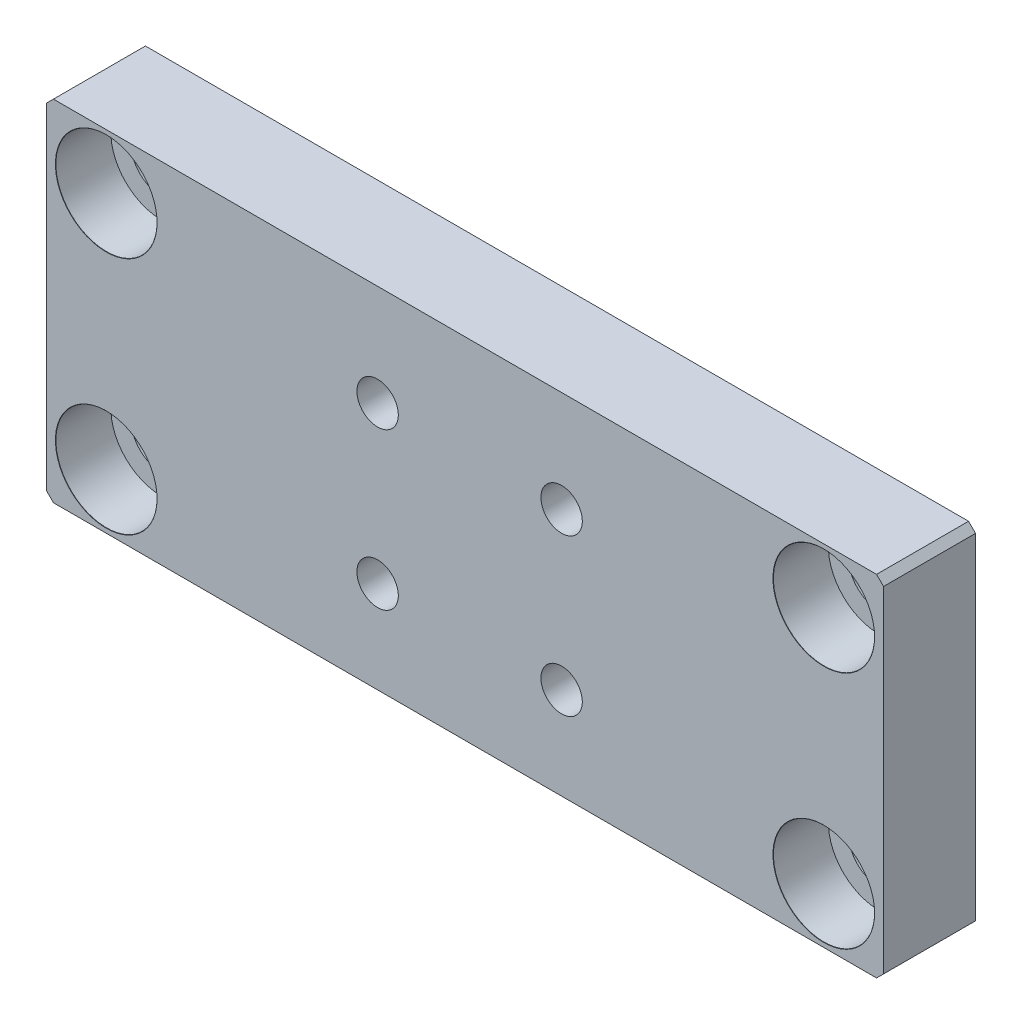
ISO-10303-21;
HEADER;
FILE_DESCRIPTION(('STEP AP214'),'2;1');
FILE_NAME('part.step','',(''),(''),'','','');
FILE_SCHEMA(('AUTOMOTIVE_DESIGN { 1 0 10303 214 1 1 1 1 }'));
ENDSEC;
DATA;
#1=APPLICATION_CONTEXT('core data for automotive mechanical design processes');
#2=APPLICATION_PROTOCOL_DEFINITION('international standard','automotive_design',2000,#1);
#3=PRODUCT_CONTEXT('',#1,'mechanical');
#4=PRODUCT('Part','Part','',(#3));
#5=PRODUCT_RELATED_PRODUCT_CATEGORY('part','',(#4));
#6=PRODUCT_DEFINITION_FORMATION('','',#4);
#7=PRODUCT_DEFINITION_CONTEXT('part definition',#1,'design');
#8=PRODUCT_DEFINITION('design','',#6,#7);
#9=PRODUCT_DEFINITION_SHAPE('','',#8);
#10=(LENGTH_UNIT() NAMED_UNIT(*) SI_UNIT(.MILLI.,.METRE.));
#11=(NAMED_UNIT(*) PLANE_ANGLE_UNIT() SI_UNIT($,.RADIAN.));
#12=(NAMED_UNIT(*) SI_UNIT($,.STERADIAN.) SOLID_ANGLE_UNIT());
#13=UNCERTAINTY_MEASURE_WITH_UNIT(LENGTH_MEASURE(1.E-05),#10,'distance_accuracy_value','');
#14=(GEOMETRIC_REPRESENTATION_CONTEXT(3) GLOBAL_UNCERTAINTY_ASSIGNED_CONTEXT((#13)) GLOBAL_UNIT_ASSIGNED_CONTEXT((#10,
#11,#12)) REPRESENTATION_CONTEXT('',''));
#15=CARTESIAN_POINT('',(0.,0.,0.));
#16=DIRECTION('',(0.,0.,1.));
#17=DIRECTION('',(1.,0.,0.));
#18=AXIS2_PLACEMENT_3D('',#15,#16,#17);
#19=CARTESIAN_POINT('',(37.0000011026499,28.99999971685,0.));
#20=DIRECTION('',(0.,0.,-1.));
#21=DIRECTION('',(-1.,0.,0.));
#22=AXIS2_PLACEMENT_3D('',#19,#20,#21);
#23=CONICAL_SURFACE('',#22,4.025,0.785398163397479);
#24=CARTESIAN_POINT('',(37.0000011026499,28.99999971685,0.0250000000000027));
#25=DIRECTION('',(0.,0.,-1.));
#26=DIRECTION('',(-1.,0.,0.));
#27=AXIS2_PLACEMENT_3D('',#24,#25,#26);
#28=CIRCLE('',#27,4.);
#29=CARTESIAN_POINT('',(33.0000011026499,28.99999971685,0.0250000000000027));
#30=VERTEX_POINT('',#29);
#31=EDGE_CURVE('E11',#30,#30,#28,.T.);
#32=ORIENTED_EDGE('',*,*,#31,.F.);
#33=EDGE_LOOP('',(#32));
#34=FACE_BOUND('',#33,.T.);
#35=CARTESIAN_POINT('',(37.0000011026499,28.99999971685,0.));
#36=DIRECTION('',(0.,0.,-1.));
#37=DIRECTION('',(-1.,0.,0.));
#38=AXIS2_PLACEMENT_3D('',#35,#36,#37);
#39=CIRCLE('',#38,4.025);
#40=CARTESIAN_POINT('',(32.9750011026498,28.99999971685,0.));
#41=VERTEX_POINT('',#40);
#42=EDGE_CURVE('E206',#41,#41,#39,.T.);
#43=ORIENTED_EDGE('',*,*,#42,.T.);
#44=EDGE_LOOP('',(#43));
#45=FACE_BOUND('',#44,.T.);
#46=ADVANCED_FACE('F33',(#34,#45),#23,.F.);
#47=CARTESIAN_POINT('',(37.0000011026499,28.99999971685,0.));
#48=DIRECTION('',(0.,0.,-1.));
#49=DIRECTION('',(-1.,0.,0.));
#50=AXIS2_PLACEMENT_3D('',#47,#48,#49);
#51=CYLINDRICAL_SURFACE('',#50,4.);
#52=CARTESIAN_POINT('',(37.0000011026499,28.99999971685,4.));
#53=DIRECTION('',(0.,0.,-1.));
#54=DIRECTION('',(-1.,0.,0.));
#55=AXIS2_PLACEMENT_3D('',#52,#53,#54);
#56=CIRCLE('',#55,4.);
#57=CARTESIAN_POINT('',(33.0000011026499,28.99999971685,4.));
#58=VERTEX_POINT('',#57);
#59=EDGE_CURVE('E41',#58,#58,#56,.T.);
#60=ORIENTED_EDGE('',*,*,#59,.F.);
#61=EDGE_LOOP('',(#60));
#62=FACE_BOUND('',#61,.T.);
#63=ORIENTED_EDGE('',*,*,#31,.T.);
#64=EDGE_LOOP('',(#63));
#65=FACE_BOUND('',#64,.T.);
#66=ADVANCED_FACE('F219',(#62,#65),#51,.F.);
#67=CARTESIAN_POINT('',(41.0000011026499,28.99999971685,4.));
#68=DIRECTION('',(0.,0.,1.));
#69=DIRECTION('',(1.,0.,0.));
#70=AXIS2_PLACEMENT_3D('',#67,#68,#69);
#71=PLANE('',#70);
#72=CARTESIAN_POINT('',(37.0000011026499,28.99999971685,4.));
#73=DIRECTION('',(0.,0.,-1.));
#74=DIRECTION('',(-1.,0.,0.));
#75=AXIS2_PLACEMENT_3D('',#72,#73,#74);
#76=CIRCLE('',#75,2.25);
#77=CARTESIAN_POINT('',(34.7500011026498,28.99999971685,4.));
#78=VERTEX_POINT('',#77);
#79=EDGE_CURVE('E212',#78,#78,#76,.T.);
#80=ORIENTED_EDGE('',*,*,#79,.F.);
#81=EDGE_LOOP('',(#80));
#82=FACE_BOUND('',#81,.T.);
#83=ORIENTED_EDGE('',*,*,#59,.T.);
#84=EDGE_LOOP('',(#83));
#85=FACE_BOUND('',#84,.T.);
#86=ADVANCED_FACE('F217',(#82,#85),#71,.F.);
#87=CARTESIAN_POINT('',(37.0000011026499,28.99999971685,0.));
#88=DIRECTION('',(0.,0.,-1.));
#89=DIRECTION('',(-1.,0.,0.));
#90=AXIS2_PLACEMENT_3D('',#87,#88,#89);
#91=CYLINDRICAL_SURFACE('',#90,2.25);
#92=CARTESIAN_POINT('',(37.0000011026499,28.99999971685,10.));
#93=DIRECTION('',(0.,0.,-1.));
#94=DIRECTION('',(-1.,0.,0.));
#95=AXIS2_PLACEMENT_3D('',#92,#93,#94);
#96=CIRCLE('',#95,2.25);
#97=CARTESIAN_POINT('',(34.7500011026499,28.99999971685,10.));
#98=VERTEX_POINT('',#97);
#99=EDGE_CURVE('E209',#98,#98,#96,.T.);
#100=ORIENTED_EDGE('',*,*,#99,.F.);
#101=EDGE_LOOP('',(#100));
#102=FACE_BOUND('',#101,.T.);
#103=ORIENTED_EDGE('',*,*,#79,.T.);
#104=EDGE_LOOP('',(#103));
#105=FACE_BOUND('',#104,.T.);
#106=ADVANCED_FACE('F318',(#102,#105),#91,.F.);
#107=CARTESIAN_POINT('',(57.0000011026499,28.99999971685,0.));
#108=DIRECTION('',(0.,0.,-1.));
#109=DIRECTION('',(-1.,0.,0.));
#110=AXIS2_PLACEMENT_3D('',#107,#108,#109);
#111=CONICAL_SURFACE('',#110,4.025,0.785398163397479);
#112=CARTESIAN_POINT('',(57.0000011026499,28.99999971685,0.0250000000000027));
#113=DIRECTION('',(0.,0.,-1.));
#114=DIRECTION('',(-1.,0.,0.));
#115=AXIS2_PLACEMENT_3D('',#112,#113,#114);
#116=CIRCLE('',#115,4.);
#117=CARTESIAN_POINT('',(53.0000011026499,28.99999971685,0.0250000000000027));
#118=VERTEX_POINT('',#117);
#119=EDGE_CURVE('E203',#118,#118,#116,.T.);
#120=ORIENTED_EDGE('',*,*,#119,.F.);
#121=EDGE_LOOP('',(#120));
#122=FACE_BOUND('',#121,.T.);
#123=CARTESIAN_POINT('',(57.0000011026499,28.99999971685,0.));
#124=DIRECTION('',(0.,0.,-1.));
#125=DIRECTION('',(-1.,0.,0.));
#126=AXIS2_PLACEMENT_3D('',#123,#124,#125);
#127=CIRCLE('',#126,4.025);
#128=CARTESIAN_POINT('',(52.9750011026499,28.99999971685,0.));
#129=VERTEX_POINT('',#128);
#130=EDGE_CURVE('E191',#129,#129,#127,.T.);
#131=ORIENTED_EDGE('',*,*,#130,.T.);
#132=EDGE_LOOP('',(#131));
#133=FACE_BOUND('',#132,.T.);
#134=ADVANCED_FACE('F314',(#122,#133),#111,.F.);
#135=CARTESIAN_POINT('',(57.0000011026499,28.99999971685,0.));
#136=DIRECTION('',(0.,0.,-1.));
#137=DIRECTION('',(-1.,0.,0.));
#138=AXIS2_PLACEMENT_3D('',#135,#136,#137);
#139=CYLINDRICAL_SURFACE('',#138,4.);
#140=CARTESIAN_POINT('',(57.0000011026499,28.99999971685,4.));
#141=DIRECTION('',(0.,0.,-1.));
#142=DIRECTION('',(-1.,0.,0.));
#143=AXIS2_PLACEMENT_3D('',#140,#141,#142);
#144=CIRCLE('',#143,4.);
#145=CARTESIAN_POINT('',(53.0000011026499,28.99999971685,4.));
#146=VERTEX_POINT('',#145);
#147=EDGE_CURVE('E200',#146,#146,#144,.T.);
#148=ORIENTED_EDGE('',*,*,#147,.F.);
#149=EDGE_LOOP('',(#148));
#150=FACE_BOUND('',#149,.T.);
#151=ORIENTED_EDGE('',*,*,#119,.T.);
#152=EDGE_LOOP('',(#151));
#153=FACE_BOUND('',#152,.T.);
#154=ADVANCED_FACE('F310',(#150,#153),#139,.F.);
#155=CARTESIAN_POINT('',(61.0000011026499,28.99999971685,4.));
#156=DIRECTION('',(0.,0.,1.));
#157=DIRECTION('',(1.,0.,0.));
#158=AXIS2_PLACEMENT_3D('',#155,#156,#157);
#159=PLANE('',#158);
#160=CARTESIAN_POINT('',(57.0000011026499,28.99999971685,4.));
#161=DIRECTION('',(0.,0.,-1.));
#162=DIRECTION('',(-1.,0.,0.));
#163=AXIS2_PLACEMENT_3D('',#160,#161,#162);
#164=CIRCLE('',#163,2.25);
#165=CARTESIAN_POINT('',(54.7500011026499,28.99999971685,4.));
#166=VERTEX_POINT('',#165);
#167=EDGE_CURVE('E197',#166,#166,#164,.T.);
#168=ORIENTED_EDGE('',*,*,#167,.F.);
#169=EDGE_LOOP('',(#168));
#170=FACE_BOUND('',#169,.T.);
#171=ORIENTED_EDGE('',*,*,#147,.T.);
#172=EDGE_LOOP('',(#171));
#173=FACE_BOUND('',#172,.T.);
#174=ADVANCED_FACE('F306',(#170,#173),#159,.F.);
#175=CARTESIAN_POINT('',(57.0000011026499,28.99999971685,0.));
#176=DIRECTION('',(0.,0.,-1.));
#177=DIRECTION('',(-1.,0.,0.));
#178=AXIS2_PLACEMENT_3D('',#175,#176,#177);
#179=CYLINDRICAL_SURFACE('',#178,2.25);
#180=CARTESIAN_POINT('',(57.0000011026499,28.99999971685,10.));
#181=DIRECTION('',(0.,0.,-1.));
#182=DIRECTION('',(-1.,0.,0.));
#183=AXIS2_PLACEMENT_3D('',#180,#181,#182);
#184=CIRCLE('',#183,2.25);
#185=CARTESIAN_POINT('',(54.7500011026499,28.99999971685,10.));
#186=VERTEX_POINT('',#185);
#187=EDGE_CURVE('E194',#186,#186,#184,.T.);
#188=ORIENTED_EDGE('',*,*,#187,.F.);
#189=EDGE_LOOP('',(#188));
#190=FACE_BOUND('',#189,.T.);
#191=ORIENTED_EDGE('',*,*,#167,.T.);
#192=EDGE_LOOP('',(#191));
#193=FACE_BOUND('',#192,.T.);
#194=ADVANCED_FACE('F302',(#190,#193),#179,.F.);
#195=CARTESIAN_POINT('',(85.5000011026498,7.99999971685001,10.));
#196=DIRECTION('',(0.,0.,1.));
#197=DIRECTION('',(1.,0.,0.));
#198=AXIS2_PLACEMENT_3D('',#195,#196,#197);
#199=CONICAL_SURFACE('',#198,5.525,0.785398163397448);
#200=CARTESIAN_POINT('',(85.5000011026498,7.99999971685001,9.975));
#201=DIRECTION('',(0.,0.,1.));
#202=DIRECTION('',(1.,0.,0.));
#203=AXIS2_PLACEMENT_3D('',#200,#201,#202);
#204=CIRCLE('',#203,5.5);
#205=CARTESIAN_POINT('',(91.0000011026498,7.99999971685001,9.975));
#206=VERTEX_POINT('',#205);
#207=EDGE_CURVE('E188',#206,#206,#204,.T.);
#208=ORIENTED_EDGE('',*,*,#207,.F.);
#209=EDGE_LOOP('',(#208));
#210=FACE_BOUND('',#209,.T.);
#211=CARTESIAN_POINT('',(85.5000011026498,7.99999971685001,10.));
#212=DIRECTION('',(0.,0.,1.));
#213=DIRECTION('',(1.,0.,0.));
#214=AXIS2_PLACEMENT_3D('',#211,#212,#213);
#215=CIRCLE('',#214,5.525);
#216=CARTESIAN_POINT('',(91.0250011026498,7.99999971685001,10.));
#217=VERTEX_POINT('',#216);
#218=EDGE_CURVE('E176',#217,#217,#215,.T.);
#219=ORIENTED_EDGE('',*,*,#218,.T.);
#220=EDGE_LOOP('',(#219));
#221=FACE_BOUND('',#220,.T.);
#222=ADVANCED_FACE('F298',(#210,#221),#199,.F.);
#223=CARTESIAN_POINT('',(85.5000011026498,7.99999971685001,10.));
#224=DIRECTION('',(0.,0.,1.));
#225=DIRECTION('',(1.,0.,0.));
#226=AXIS2_PLACEMENT_3D('',#223,#224,#225);
#227=CYLINDRICAL_SURFACE('',#226,5.5);
#228=CARTESIAN_POINT('',(85.5000011026498,7.99999971685001,4.00000000000001));
#229=DIRECTION('',(0.,0.,1.));
#230=DIRECTION('',(1.,0.,0.));
#231=AXIS2_PLACEMENT_3D('',#228,#229,#230);
#232=CIRCLE('',#231,5.5);
#233=CARTESIAN_POINT('',(91.0000011026498,7.99999971685001,4.00000000000001));
#234=VERTEX_POINT('',#233);
#235=EDGE_CURVE('E185',#234,#234,#232,.T.);
#236=ORIENTED_EDGE('',*,*,#235,.F.);
#237=EDGE_LOOP('',(#236));
#238=FACE_BOUND('',#237,.T.);
#239=ORIENTED_EDGE('',*,*,#207,.T.);
#240=EDGE_LOOP('',(#239));
#241=FACE_BOUND('',#240,.T.);
#242=ADVANCED_FACE('F294',(#238,#241),#227,.F.);
#243=CARTESIAN_POINT('',(91.0000011026498,7.99999971685001,4.00000000000001));
#244=DIRECTION('',(0.,0.,-1.));
#245=DIRECTION('',(-1.,0.,0.));
#246=AXIS2_PLACEMENT_3D('',#243,#244,#245);
#247=PLANE('',#246);
#248=CARTESIAN_POINT('',(85.5000011026498,7.99999971685001,4.00000000000001));
#249=DIRECTION('',(0.,0.,1.));
#250=DIRECTION('',(1.,0.,0.));
#251=AXIS2_PLACEMENT_3D('',#248,#249,#250);
#252=CIRCLE('',#251,3.3);
#253=CARTESIAN_POINT('',(88.8000011026498,7.99999971685001,4.00000000000001));
#254=VERTEX_POINT('',#253);
#255=EDGE_CURVE('E182',#254,#254,#252,.T.);
#256=ORIENTED_EDGE('',*,*,#255,.F.);
#257=EDGE_LOOP('',(#256));
#258=FACE_BOUND('',#257,.T.);
#259=ORIENTED_EDGE('',*,*,#235,.T.);
#260=EDGE_LOOP('',(#259));
#261=FACE_BOUND('',#260,.T.);
#262=ADVANCED_FACE('F290',(#258,#261),#247,.F.);
#263=CARTESIAN_POINT('',(85.5000011026498,7.99999971685001,10.));
#264=DIRECTION('',(0.,0.,1.));
#265=DIRECTION('',(1.,0.,0.));
#266=AXIS2_PLACEMENT_3D('',#263,#264,#265);
#267=CYLINDRICAL_SURFACE('',#266,3.3);
#268=CARTESIAN_POINT('',(85.5000011026498,7.99999971685001,0.));
#269=DIRECTION('',(0.,0.,1.));
#270=DIRECTION('',(1.,0.,0.));
#271=AXIS2_PLACEMENT_3D('',#268,#269,#270);
#272=CIRCLE('',#271,3.3);
#273=CARTESIAN_POINT('',(88.8000011026498,7.99999971685001,0.));
#274=VERTEX_POINT('',#273);
#275=EDGE_CURVE('E179',#274,#274,#272,.T.);
#276=ORIENTED_EDGE('',*,*,#275,.F.);
#277=EDGE_LOOP('',(#276));
#278=FACE_BOUND('',#277,.T.);
#279=ORIENTED_EDGE('',*,*,#255,.T.);
#280=EDGE_LOOP('',(#279));
#281=FACE_BOUND('',#280,.T.);
#282=ADVANCED_FACE('F286',(#278,#281),#267,.F.);
#283=CARTESIAN_POINT('',(7.50000110264984,7.99999971685001,10.));
#284=DIRECTION('',(0.,0.,1.));
#285=DIRECTION('',(1.,0.,0.));
#286=AXIS2_PLACEMENT_3D('',#283,#284,#285);
#287=CONICAL_SURFACE('',#286,5.525,0.785398163397448);
#288=CARTESIAN_POINT('',(7.50000110264984,7.99999971685001,9.975));
#289=DIRECTION('',(0.,0.,1.));
#290=DIRECTION('',(1.,0.,0.));
#291=AXIS2_PLACEMENT_3D('',#288,#289,#290);
#292=CIRCLE('',#291,5.5);
#293=CARTESIAN_POINT('',(13.0000011026498,7.99999971685001,9.975));
#294=VERTEX_POINT('',#293);
#295=EDGE_CURVE('E173',#294,#294,#292,.T.);
#296=ORIENTED_EDGE('',*,*,#295,.F.);
#297=EDGE_LOOP('',(#296));
#298=FACE_BOUND('',#297,.T.);
#299=CARTESIAN_POINT('',(7.50000110264984,7.99999971685001,10.));
#300=DIRECTION('',(0.,0.,1.));
#301=DIRECTION('',(1.,0.,0.));
#302=AXIS2_PLACEMENT_3D('',#299,#300,#301);
#303=CIRCLE('',#302,5.525);
#304=CARTESIAN_POINT('',(13.0250011026498,7.99999971685001,10.));
#305=VERTEX_POINT('',#304);
#306=EDGE_CURVE('E161',#305,#305,#303,.T.);
#307=ORIENTED_EDGE('',*,*,#306,.T.);
#308=EDGE_LOOP('',(#307));
#309=FACE_BOUND('',#308,.T.);
#310=ADVANCED_FACE('F282',(#298,#309),#287,.F.);
#311=CARTESIAN_POINT('',(7.50000110264984,7.99999971685001,10.));
#312=DIRECTION('',(0.,0.,1.));
#313=DIRECTION('',(1.,0.,0.));
#314=AXIS2_PLACEMENT_3D('',#311,#312,#313);
#315=CYLINDRICAL_SURFACE('',#314,5.5);
#316=CARTESIAN_POINT('',(7.50000110264984,7.99999971685001,4.00000000000001));
#317=DIRECTION('',(0.,0.,1.));
#318=DIRECTION('',(1.,0.,0.));
#319=AXIS2_PLACEMENT_3D('',#316,#317,#318);
#320=CIRCLE('',#319,5.5);
#321=CARTESIAN_POINT('',(13.0000011026498,7.99999971685001,4.00000000000001));
#322=VERTEX_POINT('',#321);
#323=EDGE_CURVE('E170',#322,#322,#320,.T.);
#324=ORIENTED_EDGE('',*,*,#323,.F.);
#325=EDGE_LOOP('',(#324));
#326=FACE_BOUND('',#325,.T.);
#327=ORIENTED_EDGE('',*,*,#295,.T.);
#328=EDGE_LOOP('',(#327));
#329=FACE_BOUND('',#328,.T.);
#330=ADVANCED_FACE('F278',(#326,#329),#315,.F.);
#331=CARTESIAN_POINT('',(13.0000011026498,7.99999971685001,4.00000000000001));
#332=DIRECTION('',(0.,0.,-1.));
#333=DIRECTION('',(-1.,0.,0.));
#334=AXIS2_PLACEMENT_3D('',#331,#332,#333);
#335=PLANE('',#334);
#336=CARTESIAN_POINT('',(7.50000110264984,7.99999971685001,4.00000000000001));
#337=DIRECTION('',(0.,0.,1.));
#338=DIRECTION('',(1.,0.,0.));
#339=AXIS2_PLACEMENT_3D('',#336,#337,#338);
#340=CIRCLE('',#339,3.3);
#341=CARTESIAN_POINT('',(10.8000011026498,7.99999971685001,4.00000000000001));
#342=VERTEX_POINT('',#341);
#343=EDGE_CURVE('E167',#342,#342,#340,.T.);
#344=ORIENTED_EDGE('',*,*,#343,.F.);
#345=EDGE_LOOP('',(#344));
#346=FACE_BOUND('',#345,.T.);
#347=ORIENTED_EDGE('',*,*,#323,.T.);
#348=EDGE_LOOP('',(#347));
#349=FACE_BOUND('',#348,.T.);
#350=ADVANCED_FACE('F274',(#346,#349),#335,.F.);
#351=CARTESIAN_POINT('',(7.50000110264984,7.99999971685001,10.));
#352=DIRECTION('',(0.,0.,1.));
#353=DIRECTION('',(1.,0.,0.));
#354=AXIS2_PLACEMENT_3D('',#351,#352,#353);
#355=CYLINDRICAL_SURFACE('',#354,3.3);
#356=CARTESIAN_POINT('',(7.50000110264984,7.99999971685001,0.));
#357=DIRECTION('',(0.,0.,1.));
#358=DIRECTION('',(1.,0.,0.));
#359=AXIS2_PLACEMENT_3D('',#356,#357,#358);
#360=CIRCLE('',#359,3.3);
#361=CARTESIAN_POINT('',(10.8000011026498,7.99999971685001,0.));
#362=VERTEX_POINT('',#361);
#363=EDGE_CURVE('E164',#362,#362,#360,.T.);
#364=ORIENTED_EDGE('',*,*,#363,.F.);
#365=EDGE_LOOP('',(#364));
#366=FACE_BOUND('',#365,.T.);
#367=ORIENTED_EDGE('',*,*,#343,.T.);
#368=EDGE_LOOP('',(#367));
#369=FACE_BOUND('',#368,.T.);
#370=ADVANCED_FACE('F270',(#366,#369),#355,.F.);
#371=CARTESIAN_POINT('',(92.0000011026499,2.75999971685,10.));
#372=DIRECTION('',(-1.,0.,0.));
#373=DIRECTION('',(0.,0.,1.));
#374=AXIS2_PLACEMENT_3D('',#371,#372,#373);
#375=PLANE('',#374);
#376=DIRECTION('',(0.,1.,0.));
#377=VECTOR('',#376,1.);
#378=CARTESIAN_POINT('',(92.0000011026499,2.75999971685,0.));
#379=LINE('',#378,#377);
#380=CARTESIAN_POINT('',(92.0000011026499,2.75999971685,0.));
#381=VERTEX_POINT('',#380);
#382=CARTESIAN_POINT('',(92.0000011026499,39.23999971685,0.));
#383=VERTEX_POINT('',#382);
#384=EDGE_CURVE('E131',#381,#383,#379,.T.);
#385=ORIENTED_EDGE('',*,*,#384,.T.);
#386=DIRECTION('',(0.,0.,-1.));
#387=VECTOR('',#386,1.);
#388=CARTESIAN_POINT('',(92.0000011026499,39.23999971685,10.));
#389=LINE('',#388,#387);
#390=CARTESIAN_POINT('',(92.0000011026499,39.23999971685,10.));
#391=VERTEX_POINT('',#390);
#392=EDGE_CURVE('E159',#391,#383,#389,.T.);
#393=ORIENTED_EDGE('',*,*,#392,.F.);
#394=DIRECTION('',(0.,1.,0.));
#395=VECTOR('',#394,1.);
#396=CARTESIAN_POINT('',(92.0000011026499,2.75999971685,10.));
#397=LINE('',#396,#395);
#398=CARTESIAN_POINT('',(92.0000011026499,2.75999971685,10.));
#399=VERTEX_POINT('',#398);
#400=EDGE_CURVE('E146',#399,#391,#397,.T.);
#401=ORIENTED_EDGE('',*,*,#400,.F.);
#402=DIRECTION('',(0.,0.,-1.));
#403=VECTOR('',#402,1.);
#404=CARTESIAN_POINT('',(92.0000011026499,2.75999971685,10.));
#405=LINE('',#404,#403);
#406=EDGE_CURVE('E127',#399,#381,#405,.T.);
#407=ORIENTED_EDGE('',*,*,#406,.T.);
#408=EDGE_LOOP('',(#385,#393,#401,#407));
#409=FACE_BOUND('',#408,.T.);
#410=ADVANCED_FACE('F267',(#409),#375,.F.);
#411=CARTESIAN_POINT('',(92.0000011026499,39.23999971685,10.));
#412=DIRECTION('',(-0.707106781186544,-0.707106781186551,0.));
#413=DIRECTION('',(0.707106781186551,-0.707106781186544,0.));
#414=AXIS2_PLACEMENT_3D('',#411,#412,#413);
#415=PLANE('',#414);
#416=DIRECTION('',(-0.707106781186551,0.707106781186544,0.));
#417=VECTOR('',#416,1.);
#418=CARTESIAN_POINT('',(92.0000011026499,39.23999971685,0.));
#419=LINE('',#418,#417);
#420=CARTESIAN_POINT('',(91.2400011026498,39.99999971685,0.));
#421=VERTEX_POINT('',#420);
#422=EDGE_CURVE('E134',#383,#421,#419,.T.);
#423=ORIENTED_EDGE('',*,*,#422,.T.);
#424=DIRECTION('',(0.,0.,-1.));
#425=VECTOR('',#424,1.);
#426=CARTESIAN_POINT('',(91.2400011026498,39.99999971685,10.));
#427=LINE('',#426,#425);
#428=CARTESIAN_POINT('',(91.2400011026498,39.99999971685,10.));
#429=VERTEX_POINT('',#428);
#430=EDGE_CURVE('E156',#429,#421,#427,.T.);
#431=ORIENTED_EDGE('',*,*,#430,.F.);
#432=DIRECTION('',(-0.707106781186551,0.707106781186544,0.));
#433=VECTOR('',#432,1.);
#434=CARTESIAN_POINT('',(92.0000011026499,39.23999971685,10.));
#435=LINE('',#434,#433);
#436=EDGE_CURVE('E93',#391,#429,#435,.T.);
#437=ORIENTED_EDGE('',*,*,#436,.F.);
#438=ORIENTED_EDGE('',*,*,#392,.T.);
#439=EDGE_LOOP('',(#423,#431,#437,#438));
#440=FACE_BOUND('',#439,.T.);
#441=ADVANCED_FACE('F263',(#440),#415,.F.);
#442=CARTESIAN_POINT('',(91.2400011026498,39.99999971685,10.));
#443=DIRECTION('',(0.,-1.,0.));
#444=DIRECTION('',(0.,0.,-1.));
#445=AXIS2_PLACEMENT_3D('',#442,#443,#444);
#446=PLANE('',#445);
#447=DIRECTION('',(-1.,0.,0.));
#448=VECTOR('',#447,1.);
#449=CARTESIAN_POINT('',(91.2400011026498,39.99999971685,0.));
#450=LINE('',#449,#448);
#451=CARTESIAN_POINT('',(1.76000110264984,39.99999971685,0.));
#452=VERTEX_POINT('',#451);
#453=EDGE_CURVE('E137',#421,#452,#450,.T.);
#454=ORIENTED_EDGE('',*,*,#453,.T.);
#455=DIRECTION('',(0.,0.,-1.));
#456=VECTOR('',#455,1.);
#457=CARTESIAN_POINT('',(1.76000110264984,39.99999971685,10.));
#458=LINE('',#457,#456);
#459=CARTESIAN_POINT('',(1.76000110264984,39.99999971685,10.));
#460=VERTEX_POINT('',#459);
#461=EDGE_CURVE('E153',#460,#452,#458,.T.);
#462=ORIENTED_EDGE('',*,*,#461,.F.);
#463=DIRECTION('',(-1.,0.,0.));
#464=VECTOR('',#463,1.);
#465=CARTESIAN_POINT('',(91.2400011026498,39.99999971685,10.));
#466=LINE('',#465,#464);
#467=EDGE_CURVE('E537',#429,#460,#466,.T.);
#468=ORIENTED_EDGE('',*,*,#467,.F.);
#469=ORIENTED_EDGE('',*,*,#430,.T.);
#470=EDGE_LOOP('',(#454,#462,#468,#469));
#471=FACE_BOUND('',#470,.T.);
#472=ADVANCED_FACE('F259',(#471),#446,.F.);
#473=CARTESIAN_POINT('',(1.76000110264984,39.99999971685,10.));
#474=DIRECTION('',(0.707106781186551,-0.707106781186544,0.));
#475=DIRECTION('',(0.707106781186544,0.707106781186551,0.));
#476=AXIS2_PLACEMENT_3D('',#473,#474,#475);
#477=PLANE('',#476);
#478=DIRECTION('',(-0.707106781186544,-0.707106781186551,0.));
#479=VECTOR('',#478,1.);
#480=CARTESIAN_POINT('',(1.76000110264984,39.99999971685,0.));
#481=LINE('',#480,#479);
#482=CARTESIAN_POINT('',(1.00000110264984,39.23999971685,0.));
#483=VERTEX_POINT('',#482);
#484=EDGE_CURVE('E139',#452,#483,#481,.T.);
#485=ORIENTED_EDGE('',*,*,#484,.T.);
#486=DIRECTION('',(0.,0.,-1.));
#487=VECTOR('',#486,1.);
#488=CARTESIAN_POINT('',(1.00000110264984,39.23999971685,10.));
#489=LINE('',#488,#487);
#490=CARTESIAN_POINT('',(1.00000110264984,39.23999971685,10.));
#491=VERTEX_POINT('',#490);
#492=EDGE_CURVE('E150',#491,#483,#489,.T.);
#493=ORIENTED_EDGE('',*,*,#492,.F.);
#494=DIRECTION('',(-0.707106781186544,-0.707106781186551,0.));
#495=VECTOR('',#494,1.);
#496=CARTESIAN_POINT('',(1.76000110264984,39.99999971685,10.));
#497=LINE('',#496,#495);
#498=EDGE_CURVE('E539',#460,#491,#497,.T.);
#499=ORIENTED_EDGE('',*,*,#498,.F.);
#500=ORIENTED_EDGE('',*,*,#461,.T.);
#501=EDGE_LOOP('',(#485,#493,#499,#500));
#502=FACE_BOUND('',#501,.T.);
#503=ADVANCED_FACE('F255',(#502),#477,.F.);
#504=CARTESIAN_POINT('',(1.00000110264984,39.23999971685,10.));
#505=DIRECTION('',(1.,0.,0.));
#506=DIRECTION('',(0.,0.,-1.));
#507=AXIS2_PLACEMENT_3D('',#504,#505,#506);
#508=PLANE('',#507);
#509=DIRECTION('',(0.,-1.,0.));
#510=VECTOR('',#509,1.);
#511=CARTESIAN_POINT('',(1.00000110264984,39.23999971685,0.));
#512=LINE('',#511,#510);
#513=CARTESIAN_POINT('',(1.00000110264984,2.75999971685,0.));
#514=VERTEX_POINT('',#513);
#515=EDGE_CURVE('E141',#483,#514,#512,.T.);
#516=ORIENTED_EDGE('',*,*,#515,.T.);
#517=DIRECTION('',(0.,0.,-1.));
#518=VECTOR('',#517,1.);
#519=CARTESIAN_POINT('',(1.00000110264984,2.75999971685,10.));
#520=LINE('',#519,#518);
#521=CARTESIAN_POINT('',(1.00000110264984,2.75999971685,10.));
#522=VERTEX_POINT('',#521);
#523=EDGE_CURVE('E122',#522,#514,#520,.T.);
#524=ORIENTED_EDGE('',*,*,#523,.F.);
#525=DIRECTION('',(0.,-1.,0.));
#526=VECTOR('',#525,1.);
#527=CARTESIAN_POINT('',(1.00000110264984,39.23999971685,10.));
#528=LINE('',#527,#526);
#529=EDGE_CURVE('E113',#491,#522,#528,.T.);
#530=ORIENTED_EDGE('',*,*,#529,.F.);
#531=ORIENTED_EDGE('',*,*,#492,.T.);
#532=EDGE_LOOP('',(#516,#524,#530,#531));
#533=FACE_BOUND('',#532,.T.);
#534=ADVANCED_FACE('F252',(#533),#508,.F.);
#535=CARTESIAN_POINT('',(1.00000110264984,2.75999971685,10.));
#536=DIRECTION('',(0.707106781186548,0.707106781186548,0.));
#537=DIRECTION('',(-0.707106781186548,0.707106781186548,0.));
#538=AXIS2_PLACEMENT_3D('',#535,#536,#537);
#539=PLANE('',#538);
#540=DIRECTION('',(0.707106781186548,-0.707106781186548,0.));
#541=VECTOR('',#540,1.);
#542=CARTESIAN_POINT('',(1.00000110264984,2.75999971685,0.));
#543=LINE('',#542,#541);
#544=CARTESIAN_POINT('',(1.76000110264984,1.99999971685,0.));
#545=VERTEX_POINT('',#544);
#546=EDGE_CURVE('E121',#514,#545,#543,.T.);
#547=ORIENTED_EDGE('',*,*,#546,.T.);
#548=DIRECTION('',(0.,0.,-1.));
#549=VECTOR('',#548,1.);
#550=CARTESIAN_POINT('',(1.76000110264984,1.99999971685,10.));
#551=LINE('',#550,#549);
#552=CARTESIAN_POINT('',(1.76000110264984,1.99999971685,10.));
#553=VERTEX_POINT('',#552);
#554=EDGE_CURVE('E118',#553,#545,#551,.T.);
#555=ORIENTED_EDGE('',*,*,#554,.F.);
#556=DIRECTION('',(0.707106781186548,-0.707106781186548,0.));
#557=VECTOR('',#556,1.);
#558=CARTESIAN_POINT('',(1.00000110264984,2.75999971685,10.));
#559=LINE('',#558,#557);
#560=EDGE_CURVE('E106',#522,#553,#559,.T.);
#561=ORIENTED_EDGE('',*,*,#560,.F.);
#562=ORIENTED_EDGE('',*,*,#523,.T.);
#563=EDGE_LOOP('',(#547,#555,#561,#562));
#564=FACE_BOUND('',#563,.T.);
#565=ADVANCED_FACE('F119',(#564),#539,.F.);
#566=CARTESIAN_POINT('',(1.76000110264984,1.99999971685,10.));
#567=DIRECTION('',(0.,1.,0.));
#568=DIRECTION('',(0.,0.,1.));
#569=AXIS2_PLACEMENT_3D('',#566,#567,#568);
#570=PLANE('',#569);
#571=DIRECTION('',(1.,0.,0.));
#572=VECTOR('',#571,1.);
#573=CARTESIAN_POINT('',(1.76000110264984,1.99999971685,0.));
#574=LINE('',#573,#572);
#575=CARTESIAN_POINT('',(91.2400011026498,1.99999971685,0.));
#576=VERTEX_POINT('',#575);
#577=EDGE_CURVE('E78',#545,#576,#574,.T.);
#578=ORIENTED_EDGE('',*,*,#577,.T.);
#579=DIRECTION('',(0.,0.,-1.));
#580=VECTOR('',#579,1.);
#581=CARTESIAN_POINT('',(91.2400011026498,1.99999971685,10.));
#582=LINE('',#581,#580);
#583=CARTESIAN_POINT('',(91.2400011026498,1.99999971685,10.));
#584=VERTEX_POINT('',#583);
#585=EDGE_CURVE('E123',#584,#576,#582,.T.);
#586=ORIENTED_EDGE('',*,*,#585,.F.);
#587=DIRECTION('',(1.,0.,0.));
#588=VECTOR('',#587,1.);
#589=CARTESIAN_POINT('',(1.76000110264984,1.99999971685,10.));
#590=LINE('',#589,#588);
#591=EDGE_CURVE('E111',#553,#584,#590,.T.);
#592=ORIENTED_EDGE('',*,*,#591,.F.);
#593=ORIENTED_EDGE('',*,*,#554,.T.);
#594=EDGE_LOOP('',(#578,#586,#592,#593));
#595=FACE_BOUND('',#594,.T.);
#596=ADVANCED_FACE('F125',(#595),#570,.F.);
#597=CARTESIAN_POINT('',(91.2400011026498,1.99999971685,10.));
#598=DIRECTION('',(-0.707106781186541,0.707106781186554,0.));
#599=DIRECTION('',(-0.707106781186554,-0.707106781186541,0.));
#600=AXIS2_PLACEMENT_3D('',#597,#598,#599);
#601=PLANE('',#600);
#602=DIRECTION('',(0.707106781186554,0.707106781186541,0.));
#603=VECTOR('',#602,1.);
#604=CARTESIAN_POINT('',(91.2400011026498,1.99999971685,0.));
#605=LINE('',#604,#603);
#606=EDGE_CURVE('E84',#576,#381,#605,.T.);
#607=ORIENTED_EDGE('',*,*,#606,.T.);
#608=ORIENTED_EDGE('',*,*,#406,.F.);
#609=DIRECTION('',(0.707106781186554,0.707106781186541,0.));
#610=VECTOR('',#609,1.);
#611=CARTESIAN_POINT('',(91.2400011026498,1.99999971685,10.));
#612=LINE('',#611,#610);
#613=EDGE_CURVE('E49',#584,#399,#612,.T.);
#614=ORIENTED_EDGE('',*,*,#613,.F.);
#615=ORIENTED_EDGE('',*,*,#585,.T.);
#616=EDGE_LOOP('',(#607,#608,#614,#615));
#617=FACE_BOUND('',#616,.T.);
#618=ADVANCED_FACE('F240',(#617),#601,.F.);
#619=CARTESIAN_POINT('',(0.,0.,10.));
#620=DIRECTION('',(0.,0.,1.));
#621=DIRECTION('',(1.,0.,0.));
#622=AXIS2_PLACEMENT_3D('',#619,#620,#621);
#623=PLANE('',#622);
#624=CARTESIAN_POINT('',(37.0000011026499,11.99999971685,10.));
#625=DIRECTION('',(0.,0.,-1.));
#626=DIRECTION('',(-1.,0.,0.));
#627=AXIS2_PLACEMENT_3D('',#624,#625,#626);
#628=CIRCLE('',#627,2.25);
#629=CARTESIAN_POINT('',(34.7500011026499,11.99999971685,10.));
#630=VERTEX_POINT('',#629);
#631=EDGE_CURVE('E629',#630,#630,#628,.T.);
#632=ORIENTED_EDGE('',*,*,#631,.T.);
#633=EDGE_LOOP('',(#632));
#634=FACE_BOUND('',#633,.T.);
#635=CARTESIAN_POINT('',(57.0000011026499,11.99999971685,10.));
#636=DIRECTION('',(0.,0.,-1.));
#637=DIRECTION('',(-1.,0.,0.));
#638=AXIS2_PLACEMENT_3D('',#635,#636,#637);
#639=CIRCLE('',#638,2.25);
#640=CARTESIAN_POINT('',(54.7500011026499,11.99999971685,10.));
#641=VERTEX_POINT('',#640);
#642=EDGE_CURVE('E605',#641,#641,#639,.T.);
#643=ORIENTED_EDGE('',*,*,#642,.T.);
#644=EDGE_LOOP('',(#643));
#645=FACE_BOUND('',#644,.T.);
#646=CARTESIAN_POINT('',(85.5000011026498,33.99999971685,10.));
#647=DIRECTION('',(0.,0.,1.));
#648=DIRECTION('',(1.,0.,0.));
#649=AXIS2_PLACEMENT_3D('',#646,#647,#648);
#650=CIRCLE('',#649,5.525);
#651=CARTESIAN_POINT('',(91.0250011026498,33.99999971685,10.));
#652=VERTEX_POINT('',#651);
#653=EDGE_CURVE('E602',#652,#652,#650,.T.);
#654=ORIENTED_EDGE('',*,*,#653,.F.);
#655=EDGE_LOOP('',(#654));
#656=FACE_BOUND('',#655,.T.);
#657=CARTESIAN_POINT('',(7.50000110264984,33.99999971685,10.));
#658=DIRECTION('',(0.,0.,1.));
#659=DIRECTION('',(1.,0.,0.));
#660=AXIS2_PLACEMENT_3D('',#657,#658,#659);
#661=CIRCLE('',#660,5.525);
#662=CARTESIAN_POINT('',(13.0250011026498,33.99999971685,10.));
#663=VERTEX_POINT('',#662);
#664=EDGE_CURVE('E529',#663,#663,#661,.T.);
#665=ORIENTED_EDGE('',*,*,#664,.F.);
#666=EDGE_LOOP('',(#665));
#667=FACE_BOUND('',#666,.T.);
#668=ORIENTED_EDGE('',*,*,#400,.T.);
#669=ORIENTED_EDGE('',*,*,#436,.T.);
#670=ORIENTED_EDGE('',*,*,#467,.T.);
#671=ORIENTED_EDGE('',*,*,#498,.T.);
#672=ORIENTED_EDGE('',*,*,#529,.T.);
#673=ORIENTED_EDGE('',*,*,#560,.T.);
#674=ORIENTED_EDGE('',*,*,#591,.T.);
#675=ORIENTED_EDGE('',*,*,#613,.T.);
#676=EDGE_LOOP('',(#668,#669,#670,#671,#672,#673,#674,#675));
#677=FACE_BOUND('',#676,.T.);
#678=ORIENTED_EDGE('',*,*,#306,.F.);
#679=EDGE_LOOP('',(#678));
#680=FACE_BOUND('',#679,.T.);
#681=ORIENTED_EDGE('',*,*,#218,.F.);
#682=EDGE_LOOP('',(#681));
#683=FACE_BOUND('',#682,.T.);
#684=ORIENTED_EDGE('',*,*,#187,.T.);
#685=EDGE_LOOP('',(#684));
#686=FACE_BOUND('',#685,.T.);
#687=ORIENTED_EDGE('',*,*,#99,.T.);
#688=EDGE_LOOP('',(#687));
#689=FACE_BOUND('',#688,.T.);
#690=ADVANCED_FACE('F108',(#634,#645,#656,#667,#677,#680,#683,#686,#689),#623,.T.);
#691=CARTESIAN_POINT('',(0.,0.,0.));
#692=DIRECTION('',(0.,0.,1.));
#693=DIRECTION('',(1.,0.,0.));
#694=AXIS2_PLACEMENT_3D('',#691,#692,#693);
#695=PLANE('',#694);
#696=CARTESIAN_POINT('',(37.0000011026499,11.99999971685,0.));
#697=DIRECTION('',(0.,0.,-1.));
#698=DIRECTION('',(-1.,0.,0.));
#699=AXIS2_PLACEMENT_3D('',#696,#697,#698);
#700=CIRCLE('',#699,4.025);
#701=CARTESIAN_POINT('',(32.9750011026498,11.99999971685,0.));
#702=VERTEX_POINT('',#701);
#703=EDGE_CURVE('E632',#702,#702,#700,.T.);
#704=ORIENTED_EDGE('',*,*,#703,.F.);
#705=EDGE_LOOP('',(#704));
#706=FACE_BOUND('',#705,.T.);
#707=CARTESIAN_POINT('',(57.0000011026499,11.99999971685,0.));
#708=DIRECTION('',(0.,0.,-1.));
#709=DIRECTION('',(-1.,0.,0.));
#710=AXIS2_PLACEMENT_3D('',#707,#708,#709);
#711=CIRCLE('',#710,4.025);
#712=CARTESIAN_POINT('',(52.9750011026499,11.99999971685,0.));
#713=VERTEX_POINT('',#712);
#714=EDGE_CURVE('E617',#713,#713,#711,.T.);
#715=ORIENTED_EDGE('',*,*,#714,.F.);
#716=EDGE_LOOP('',(#715));
#717=FACE_BOUND('',#716,.T.);
#718=CARTESIAN_POINT('',(85.5000011026498,33.99999971685,0.));
#719=DIRECTION('',(0.,0.,1.));
#720=DIRECTION('',(1.,0.,0.));
#721=AXIS2_PLACEMENT_3D('',#718,#719,#720);
#722=CIRCLE('',#721,3.3);
#723=CARTESIAN_POINT('',(88.8000011026498,33.99999971685,0.));
#724=VERTEX_POINT('',#723);
#725=EDGE_CURVE('E599',#724,#724,#722,.T.);
#726=ORIENTED_EDGE('',*,*,#725,.T.);
#727=EDGE_LOOP('',(#726));
#728=FACE_BOUND('',#727,.T.);
#729=CARTESIAN_POINT('',(7.50000110264984,33.99999971685,0.));
#730=DIRECTION('',(0.,0.,1.));
#731=DIRECTION('',(1.,0.,0.));
#732=AXIS2_PLACEMENT_3D('',#729,#730,#731);
#733=CIRCLE('',#732,3.3);
#734=CARTESIAN_POINT('',(10.8000011026498,33.99999971685,0.));
#735=VERTEX_POINT('',#734);
#736=EDGE_CURVE('E135',#735,#735,#733,.T.);
#737=ORIENTED_EDGE('',*,*,#736,.T.);
#738=EDGE_LOOP('',(#737));
#739=FACE_BOUND('',#738,.T.);
#740=ORIENTED_EDGE('',*,*,#384,.F.);
#741=ORIENTED_EDGE('',*,*,#606,.F.);
#742=ORIENTED_EDGE('',*,*,#577,.F.);
#743=ORIENTED_EDGE('',*,*,#546,.F.);
#744=ORIENTED_EDGE('',*,*,#515,.F.);
#745=ORIENTED_EDGE('',*,*,#484,.F.);
#746=ORIENTED_EDGE('',*,*,#453,.F.);
#747=ORIENTED_EDGE('',*,*,#422,.F.);
#748=EDGE_LOOP('',(#740,#741,#742,#743,#744,#745,#746,#747));
#749=FACE_BOUND('',#748,.T.);
#750=ORIENTED_EDGE('',*,*,#363,.T.);
#751=EDGE_LOOP('',(#750));
#752=FACE_BOUND('',#751,.T.);
#753=ORIENTED_EDGE('',*,*,#275,.T.);
#754=EDGE_LOOP('',(#753));
#755=FACE_BOUND('',#754,.T.);
#756=ORIENTED_EDGE('',*,*,#130,.F.);
#757=EDGE_LOOP('',(#756));
#758=FACE_BOUND('',#757,.T.);
#759=ORIENTED_EDGE('',*,*,#42,.F.);
#760=EDGE_LOOP('',(#759));
#761=FACE_BOUND('',#760,.T.);
#762=ADVANCED_FACE('F228',(#706,#717,#728,#739,#749,#752,#755,#758,#761),#695,.F.);
#763=CARTESIAN_POINT('',(7.50000110264984,33.99999971685,10.));
#764=DIRECTION('',(0.,0.,1.));
#765=DIRECTION('',(1.,0.,0.));
#766=AXIS2_PLACEMENT_3D('',#763,#764,#765);
#767=CYLINDRICAL_SURFACE('',#766,3.3);
#768=ORIENTED_EDGE('',*,*,#736,.F.);
#769=EDGE_LOOP('',(#768));
#770=FACE_BOUND('',#769,.T.);
#771=CARTESIAN_POINT('',(7.50000110264984,33.99999971685,4.00000000000001));
#772=DIRECTION('',(0.,0.,1.));
#773=DIRECTION('',(1.,0.,0.));
#774=AXIS2_PLACEMENT_3D('',#771,#772,#773);
#775=CIRCLE('',#774,3.3);
#776=CARTESIAN_POINT('',(10.8000011026498,33.99999971685,4.00000000000001));
#777=VERTEX_POINT('',#776);
#778=EDGE_CURVE('E521',#777,#777,#775,.T.);
#779=ORIENTED_EDGE('',*,*,#778,.T.);
#780=EDGE_LOOP('',(#779));
#781=FACE_BOUND('',#780,.T.);
#782=ADVANCED_FACE('F230',(#770,#781),#767,.F.);
#783=CARTESIAN_POINT('',(13.0000011026498,33.99999971685,4.00000000000001));
#784=DIRECTION('',(0.,0.,-1.));
#785=DIRECTION('',(-1.,0.,0.));
#786=AXIS2_PLACEMENT_3D('',#783,#784,#785);
#787=PLANE('',#786);
#788=ORIENTED_EDGE('',*,*,#778,.F.);
#789=EDGE_LOOP('',(#788));
#790=FACE_BOUND('',#789,.T.);
#791=CARTESIAN_POINT('',(7.50000110264984,33.99999971685,4.00000000000001));
#792=DIRECTION('',(0.,0.,1.));
#793=DIRECTION('',(1.,0.,0.));
#794=AXIS2_PLACEMENT_3D('',#791,#792,#793);
#795=CIRCLE('',#794,5.5);
#796=CARTESIAN_POINT('',(13.0000011026498,33.99999971685,4.00000000000001));
#797=VERTEX_POINT('',#796);
#798=EDGE_CURVE('E524',#797,#797,#795,.T.);
#799=ORIENTED_EDGE('',*,*,#798,.T.);
#800=EDGE_LOOP('',(#799));
#801=FACE_BOUND('',#800,.T.);
#802=ADVANCED_FACE('F237',(#790,#801),#787,.F.);
#803=CARTESIAN_POINT('',(7.50000110264984,33.99999971685,10.));
#804=DIRECTION('',(0.,0.,1.));
#805=DIRECTION('',(1.,0.,0.));
#806=AXIS2_PLACEMENT_3D('',#803,#804,#805);
#807=CYLINDRICAL_SURFACE('',#806,5.5);
#808=ORIENTED_EDGE('',*,*,#798,.F.);
#809=EDGE_LOOP('',(#808));
#810=FACE_BOUND('',#809,.T.);
#811=CARTESIAN_POINT('',(7.50000110264984,33.99999971685,9.975));
#812=DIRECTION('',(0.,0.,1.));
#813=DIRECTION('',(1.,0.,0.));
#814=AXIS2_PLACEMENT_3D('',#811,#812,#813);
#815=CIRCLE('',#814,5.5);
#816=CARTESIAN_POINT('',(13.0000011026498,33.99999971685,9.975));
#817=VERTEX_POINT('',#816);
#818=EDGE_CURVE('E525',#817,#817,#815,.T.);
#819=ORIENTED_EDGE('',*,*,#818,.T.);
#820=EDGE_LOOP('',(#819));
#821=FACE_BOUND('',#820,.T.);
#822=ADVANCED_FACE('F509',(#810,#821),#807,.F.);
#823=CARTESIAN_POINT('',(7.50000110264984,33.99999971685,10.));
#824=DIRECTION('',(0.,0.,1.));
#825=DIRECTION('',(1.,0.,0.));
#826=AXIS2_PLACEMENT_3D('',#823,#824,#825);
#827=CONICAL_SURFACE('',#826,5.525,0.785398163397448);
#828=ORIENTED_EDGE('',*,*,#818,.F.);
#829=EDGE_LOOP('',(#828));
#830=FACE_BOUND('',#829,.T.);
#831=ORIENTED_EDGE('',*,*,#664,.T.);
#832=EDGE_LOOP('',(#831));
#833=FACE_BOUND('',#832,.T.);
#834=ADVANCED_FACE('F505',(#830,#833),#827,.F.);
#835=CARTESIAN_POINT('',(85.5000011026498,33.99999971685,10.));
#836=DIRECTION('',(0.,0.,1.));
#837=DIRECTION('',(1.,0.,0.));
#838=AXIS2_PLACEMENT_3D('',#835,#836,#837);
#839=CYLINDRICAL_SURFACE('',#838,3.3);
#840=ORIENTED_EDGE('',*,*,#725,.F.);
#841=EDGE_LOOP('',(#840));
#842=FACE_BOUND('',#841,.T.);
#843=CARTESIAN_POINT('',(85.5000011026498,33.99999971685,4.00000000000001));
#844=DIRECTION('',(0.,0.,1.));
#845=DIRECTION('',(1.,0.,0.));
#846=AXIS2_PLACEMENT_3D('',#843,#844,#845);
#847=CIRCLE('',#846,3.3);
#848=CARTESIAN_POINT('',(88.8000011026498,33.99999971685,4.00000000000001));
#849=VERTEX_POINT('',#848);
#850=EDGE_CURVE('E590',#849,#849,#847,.T.);
#851=ORIENTED_EDGE('',*,*,#850,.T.);
#852=EDGE_LOOP('',(#851));
#853=FACE_BOUND('',#852,.T.);
#854=ADVANCED_FACE('F501',(#842,#853),#839,.F.);
#855=CARTESIAN_POINT('',(91.0000011026498,33.99999971685,4.00000000000001));
#856=DIRECTION('',(0.,0.,-1.));
#857=DIRECTION('',(-1.,0.,0.));
#858=AXIS2_PLACEMENT_3D('',#855,#856,#857);
#859=PLANE('',#858);
#860=ORIENTED_EDGE('',*,*,#850,.F.);
#861=EDGE_LOOP('',(#860));
#862=FACE_BOUND('',#861,.T.);
#863=CARTESIAN_POINT('',(85.5000011026498,33.99999971685,4.00000000000001));
#864=DIRECTION('',(0.,0.,1.));
#865=DIRECTION('',(1.,0.,0.));
#866=AXIS2_PLACEMENT_3D('',#863,#864,#865);
#867=CIRCLE('',#866,5.5);
#868=CARTESIAN_POINT('',(91.0000011026498,33.99999971685,4.00000000000001));
#869=VERTEX_POINT('',#868);
#870=EDGE_CURVE('E593',#869,#869,#867,.T.);
#871=ORIENTED_EDGE('',*,*,#870,.T.);
#872=EDGE_LOOP('',(#871));
#873=FACE_BOUND('',#872,.T.);
#874=ADVANCED_FACE('F497',(#862,#873),#859,.F.);
#875=CARTESIAN_POINT('',(85.5000011026498,33.99999971685,10.));
#876=DIRECTION('',(0.,0.,1.));
#877=DIRECTION('',(1.,0.,0.));
#878=AXIS2_PLACEMENT_3D('',#875,#876,#877);
#879=CYLINDRICAL_SURFACE('',#878,5.5);
#880=ORIENTED_EDGE('',*,*,#870,.F.);
#881=EDGE_LOOP('',(#880));
#882=FACE_BOUND('',#881,.T.);
#883=CARTESIAN_POINT('',(85.5000011026498,33.99999971685,9.975));
#884=DIRECTION('',(0.,0.,1.));
#885=DIRECTION('',(1.,0.,0.));
#886=AXIS2_PLACEMENT_3D('',#883,#884,#885);
#887=CIRCLE('',#886,5.5);
#888=CARTESIAN_POINT('',(91.0000011026498,33.99999971685,9.975));
#889=VERTEX_POINT('',#888);
#890=EDGE_CURVE('E596',#889,#889,#887,.T.);
#891=ORIENTED_EDGE('',*,*,#890,.T.);
#892=EDGE_LOOP('',(#891));
#893=FACE_BOUND('',#892,.T.);
#894=ADVANCED_FACE('F493',(#882,#893),#879,.F.);
#895=CARTESIAN_POINT('',(85.5000011026498,33.99999971685,10.));
#896=DIRECTION('',(0.,0.,1.));
#897=DIRECTION('',(1.,0.,0.));
#898=AXIS2_PLACEMENT_3D('',#895,#896,#897);
#899=CONICAL_SURFACE('',#898,5.525,0.785398163397448);
#900=ORIENTED_EDGE('',*,*,#890,.F.);
#901=EDGE_LOOP('',(#900));
#902=FACE_BOUND('',#901,.T.);
#903=ORIENTED_EDGE('',*,*,#653,.T.);
#904=EDGE_LOOP('',(#903));
#905=FACE_BOUND('',#904,.T.);
#906=ADVANCED_FACE('F489',(#902,#905),#899,.F.);
#907=CARTESIAN_POINT('',(57.0000011026499,11.99999971685,0.));
#908=DIRECTION('',(0.,0.,-1.));
#909=DIRECTION('',(-1.,0.,0.));
#910=AXIS2_PLACEMENT_3D('',#907,#908,#909);
#911=CYLINDRICAL_SURFACE('',#910,2.25);
#912=ORIENTED_EDGE('',*,*,#642,.F.);
#913=EDGE_LOOP('',(#912));
#914=FACE_BOUND('',#913,.T.);
#915=CARTESIAN_POINT('',(57.0000011026499,11.99999971685,4.));
#916=DIRECTION('',(0.,0.,-1.));
#917=DIRECTION('',(-1.,0.,0.));
#918=AXIS2_PLACEMENT_3D('',#915,#916,#917);
#919=CIRCLE('',#918,2.25);
#920=CARTESIAN_POINT('',(54.7500011026499,11.99999971685,4.));
#921=VERTEX_POINT('',#920);
#922=EDGE_CURVE('E608',#921,#921,#919,.T.);
#923=ORIENTED_EDGE('',*,*,#922,.T.);
#924=EDGE_LOOP('',(#923));
#925=FACE_BOUND('',#924,.T.);
#926=ADVANCED_FACE('F485',(#914,#925),#911,.F.);
#927=CARTESIAN_POINT('',(61.0000011026499,11.99999971685,4.));
#928=DIRECTION('',(0.,0.,1.));
#929=DIRECTION('',(1.,0.,0.));
#930=AXIS2_PLACEMENT_3D('',#927,#928,#929);
#931=PLANE('',#930);
#932=ORIENTED_EDGE('',*,*,#922,.F.);
#933=EDGE_LOOP('',(#932));
#934=FACE_BOUND('',#933,.T.);
#935=CARTESIAN_POINT('',(57.0000011026499,11.99999971685,4.));
#936=DIRECTION('',(0.,0.,-1.));
#937=DIRECTION('',(-1.,0.,0.));
#938=AXIS2_PLACEMENT_3D('',#935,#936,#937);
#939=CIRCLE('',#938,4.);
#940=CARTESIAN_POINT('',(53.0000011026499,11.99999971685,4.));
#941=VERTEX_POINT('',#940);
#942=EDGE_CURVE('E611',#941,#941,#939,.T.);
#943=ORIENTED_EDGE('',*,*,#942,.T.);
#944=EDGE_LOOP('',(#943));
#945=FACE_BOUND('',#944,.T.);
#946=ADVANCED_FACE('F481',(#934,#945),#931,.F.);
#947=CARTESIAN_POINT('',(57.0000011026499,11.99999971685,0.));
#948=DIRECTION('',(0.,0.,-1.));
#949=DIRECTION('',(-1.,0.,0.));
#950=AXIS2_PLACEMENT_3D('',#947,#948,#949);
#951=CYLINDRICAL_SURFACE('',#950,4.);
#952=ORIENTED_EDGE('',*,*,#942,.F.);
#953=EDGE_LOOP('',(#952));
#954=FACE_BOUND('',#953,.T.);
#955=CARTESIAN_POINT('',(57.0000011026499,11.99999971685,0.0250000000000027));
#956=DIRECTION('',(0.,0.,-1.));
#957=DIRECTION('',(-1.,0.,0.));
#958=AXIS2_PLACEMENT_3D('',#955,#956,#957);
#959=CIRCLE('',#958,4.);
#960=CARTESIAN_POINT('',(53.0000011026499,11.99999971685,0.0250000000000027));
#961=VERTEX_POINT('',#960);
#962=EDGE_CURVE('E614',#961,#961,#959,.T.);
#963=ORIENTED_EDGE('',*,*,#962,.T.);
#964=EDGE_LOOP('',(#963));
#965=FACE_BOUND('',#964,.T.);
#966=ADVANCED_FACE('F477',(#954,#965),#951,.F.);
#967=CARTESIAN_POINT('',(57.0000011026499,11.99999971685,0.));
#968=DIRECTION('',(0.,0.,-1.));
#969=DIRECTION('',(-1.,0.,0.));
#970=AXIS2_PLACEMENT_3D('',#967,#968,#969);
#971=CONICAL_SURFACE('',#970,4.025,0.785398163397479);
#972=ORIENTED_EDGE('',*,*,#962,.F.);
#973=EDGE_LOOP('',(#972));
#974=FACE_BOUND('',#973,.T.);
#975=ORIENTED_EDGE('',*,*,#714,.T.);
#976=EDGE_LOOP('',(#975));
#977=FACE_BOUND('',#976,.T.);
#978=ADVANCED_FACE('F438',(#974,#977),#971,.F.);
#979=CARTESIAN_POINT('',(37.0000011026499,11.99999971685,0.));
#980=DIRECTION('',(0.,0.,-1.));
#981=DIRECTION('',(-1.,0.,0.));
#982=AXIS2_PLACEMENT_3D('',#979,#980,#981);
#983=CYLINDRICAL_SURFACE('',#982,2.25);
#984=ORIENTED_EDGE('',*,*,#631,.F.);
#985=EDGE_LOOP('',(#984));
#986=FACE_BOUND('',#985,.T.);
#987=CARTESIAN_POINT('',(37.0000011026499,11.99999971685,4.));
#988=DIRECTION('',(0.,0.,-1.));
#989=DIRECTION('',(-1.,0.,0.));
#990=AXIS2_PLACEMENT_3D('',#987,#988,#989);
#991=CIRCLE('',#990,2.25);
#992=CARTESIAN_POINT('',(34.7500011026498,11.99999971685,4.));
#993=VERTEX_POINT('',#992);
#994=EDGE_CURVE('E620',#993,#993,#991,.T.);
#995=ORIENTED_EDGE('',*,*,#994,.T.);
#996=EDGE_LOOP('',(#995));
#997=FACE_BOUND('',#996,.T.);
#998=ADVANCED_FACE('F432',(#986,#997),#983,.F.);
#999=CARTESIAN_POINT('',(41.0000011026499,11.99999971685,4.));
#1000=DIRECTION('',(0.,0.,1.));
#1001=DIRECTION('',(1.,0.,0.));
#1002=AXIS2_PLACEMENT_3D('',#999,#1000,#1001);
#1003=PLANE('',#1002);
#1004=ORIENTED_EDGE('',*,*,#994,.F.);
#1005=EDGE_LOOP('',(#1004));
#1006=FACE_BOUND('',#1005,.T.);
#1007=CARTESIAN_POINT('',(37.0000011026499,11.99999971685,4.));
#1008=DIRECTION('',(0.,0.,-1.));
#1009=DIRECTION('',(-1.,0.,0.));
#1010=AXIS2_PLACEMENT_3D('',#1007,#1008,#1009);
#1011=CIRCLE('',#1010,4.);
#1012=CARTESIAN_POINT('',(33.0000011026499,11.99999971685,4.));
#1013=VERTEX_POINT('',#1012);
#1014=EDGE_CURVE('E623',#1013,#1013,#1011,.T.);
#1015=ORIENTED_EDGE('',*,*,#1014,.T.);
#1016=EDGE_LOOP('',(#1015));
#1017=FACE_BOUND('',#1016,.T.);
#1018=ADVANCED_FACE('F437',(#1006,#1017),#1003,.F.);
#1019=CARTESIAN_POINT('',(37.0000011026499,11.99999971685,0.));
#1020=DIRECTION('',(0.,0.,-1.));
#1021=DIRECTION('',(-1.,0.,0.));
#1022=AXIS2_PLACEMENT_3D('',#1019,#1020,#1021);
#1023=CYLINDRICAL_SURFACE('',#1022,4.);
#1024=ORIENTED_EDGE('',*,*,#1014,.F.);
#1025=EDGE_LOOP('',(#1024));
#1026=FACE_BOUND('',#1025,.T.);
#1027=CARTESIAN_POINT('',(37.0000011026499,11.99999971685,0.0250000000000027));
#1028=DIRECTION('',(0.,0.,-1.));
#1029=DIRECTION('',(-1.,0.,0.));
#1030=AXIS2_PLACEMENT_3D('',#1027,#1028,#1029);
#1031=CIRCLE('',#1030,4.);
#1032=CARTESIAN_POINT('',(33.0000011026499,11.99999971685,0.0250000000000027));
#1033=VERTEX_POINT('',#1032);
#1034=EDGE_CURVE('E626',#1033,#1033,#1031,.T.);
#1035=ORIENTED_EDGE('',*,*,#1034,.T.);
#1036=EDGE_LOOP('',(#1035));
#1037=FACE_BOUND('',#1036,.T.);
#1038=ADVANCED_FACE('F449',(#1026,#1037),#1023,.F.);
#1039=CARTESIAN_POINT('',(37.0000011026499,11.99999971685,0.));
#1040=DIRECTION('',(0.,0.,-1.));
#1041=DIRECTION('',(-1.,0.,0.));
#1042=AXIS2_PLACEMENT_3D('',#1039,#1040,#1041);
#1043=CONICAL_SURFACE('',#1042,4.025,0.785398163397479);
#1044=ORIENTED_EDGE('',*,*,#1034,.F.);
#1045=EDGE_LOOP('',(#1044));
#1046=FACE_BOUND('',#1045,.T.);
#1047=ORIENTED_EDGE('',*,*,#703,.T.);
#1048=EDGE_LOOP('',(#1047));
#1049=FACE_BOUND('',#1048,.T.);
#1050=ADVANCED_FACE('F459',(#1046,#1049),#1043,.F.);
#1051=CLOSED_SHELL('',(#46,#66,#86,#106,#134,#154,#174,#194,#222,#242,#262,#282,#310,#330,#350,
#370,#410,#441,#472,#503,#534,#565,#596,#618,#690,#762,#782,#802,#822,#834,#854,#874,#894,#906,
#926,#946,#966,#978,#998,#1018,#1038,#1050));
#1052=MANIFOLD_SOLID_BREP('B2',#1051);
#1053=ADVANCED_BREP_SHAPE_REPRESENTATION('',(#18,#1052),#14);
#1054=SHAPE_DEFINITION_REPRESENTATION(#9,#1053);
ENDSEC;
END-ISO-10303-21;
